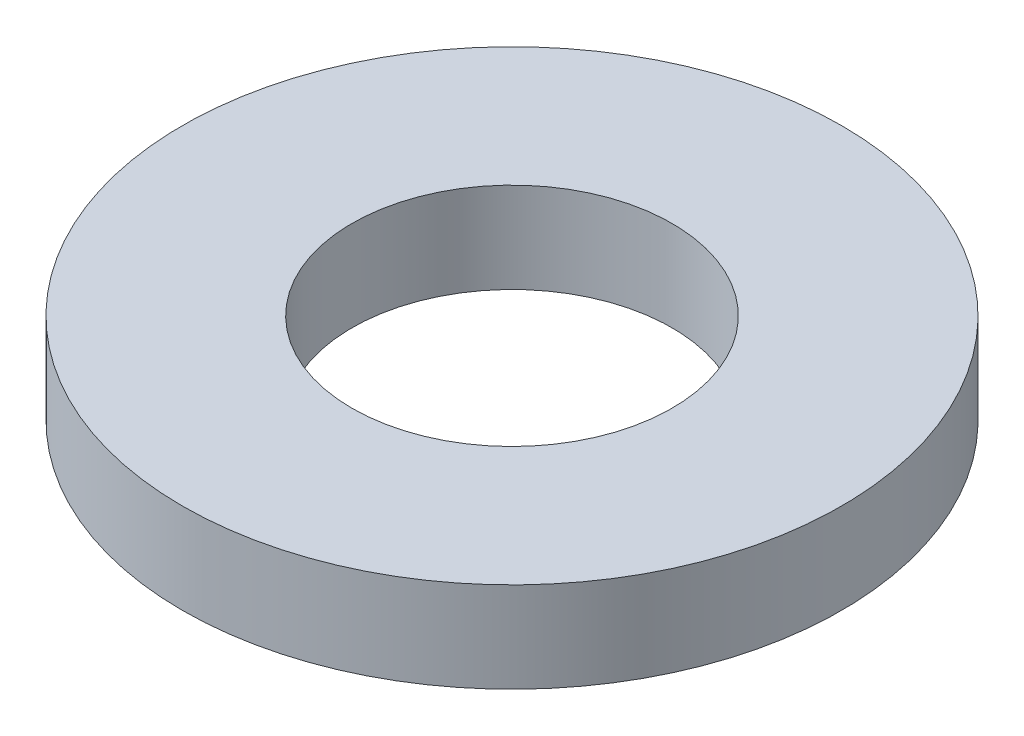
ISO-10303-21;
HEADER;
FILE_DESCRIPTION(('STEP AP214'),'2;1');
FILE_NAME('part.step','',(''),(''),'','','');
FILE_SCHEMA(('AUTOMOTIVE_DESIGN { 1 0 10303 214 1 1 1 1 }'));
ENDSEC;
DATA;
#1=APPLICATION_CONTEXT('core data for automotive mechanical design processes');
#2=APPLICATION_PROTOCOL_DEFINITION('international standard','automotive_design',2000,#1);
#3=PRODUCT_CONTEXT('',#1,'mechanical');
#4=PRODUCT('Part','Part','',(#3));
#5=PRODUCT_RELATED_PRODUCT_CATEGORY('part','',(#4));
#6=PRODUCT_DEFINITION_FORMATION('','',#4);
#7=PRODUCT_DEFINITION_CONTEXT('part definition',#1,'design');
#8=PRODUCT_DEFINITION('design','',#6,#7);
#9=PRODUCT_DEFINITION_SHAPE('','',#8);
#10=(LENGTH_UNIT() NAMED_UNIT(*) SI_UNIT(.MILLI.,.METRE.));
#11=(NAMED_UNIT(*) PLANE_ANGLE_UNIT() SI_UNIT($,.RADIAN.));
#12=(NAMED_UNIT(*) SI_UNIT($,.STERADIAN.) SOLID_ANGLE_UNIT());
#13=UNCERTAINTY_MEASURE_WITH_UNIT(LENGTH_MEASURE(1.E-05),#10,'distance_accuracy_value','');
#14=(GEOMETRIC_REPRESENTATION_CONTEXT(3) GLOBAL_UNCERTAINTY_ASSIGNED_CONTEXT((#13)) GLOBAL_UNIT_ASSIGNED_CONTEXT((#10,
#11,#12)) REPRESENTATION_CONTEXT('',''));
#15=CARTESIAN_POINT('',(0.,0.,0.));
#16=DIRECTION('',(0.,0.,1.));
#17=DIRECTION('',(1.,0.,0.));
#18=AXIS2_PLACEMENT_3D('',#15,#16,#17);
#19=CARTESIAN_POINT('',(0.,24.,0.));
#20=DIRECTION('',(0.,-1.,0.));
#21=DIRECTION('',(0.,0.,-1.));
#22=AXIS2_PLACEMENT_3D('',#19,#20,#21);
#23=CYLINDRICAL_SURFACE('',#22,87.5);
#24=CARTESIAN_POINT('',(0.,24.,0.));
#25=DIRECTION('',(0.,1.,0.));
#26=DIRECTION('',(0.,0.,1.));
#27=AXIS2_PLACEMENT_3D('',#24,#25,#26);
#28=CIRCLE('',#27,87.5);
#29=CARTESIAN_POINT('',(0.,24.,87.5));
#30=VERTEX_POINT('',#29);
#31=EDGE_CURVE('E10',#30,#30,#28,.T.);
#32=ORIENTED_EDGE('',*,*,#31,.F.);
#33=EDGE_LOOP('',(#32));
#34=FACE_BOUND('',#33,.T.);
#35=CARTESIAN_POINT('',(0.,0.,0.));
#36=DIRECTION('',(0.,1.,0.));
#37=DIRECTION('',(0.,0.,1.));
#38=AXIS2_PLACEMENT_3D('',#35,#36,#37);
#39=CIRCLE('',#38,87.5);
#40=CARTESIAN_POINT('',(0.,0.,87.5));
#41=VERTEX_POINT('',#40);
#42=EDGE_CURVE('E37',#41,#41,#39,.T.);
#43=ORIENTED_EDGE('',*,*,#42,.T.);
#44=EDGE_LOOP('',(#43));
#45=FACE_BOUND('',#44,.T.);
#46=ADVANCED_FACE('F40',(#34,#45),#23,.T.);
#47=CARTESIAN_POINT('',(0.,24.,0.));
#48=DIRECTION('',(0.,1.,0.));
#49=DIRECTION('',(0.,0.,1.));
#50=AXIS2_PLACEMENT_3D('',#47,#48,#49);
#51=PLANE('',#50);
#52=CARTESIAN_POINT('',(0.,24.,0.));
#53=DIRECTION('',(0.,1.,0.));
#54=DIRECTION('',(0.,0.,1.));
#55=AXIS2_PLACEMENT_3D('',#52,#53,#54);
#56=CIRCLE('',#55,42.5);
#57=CARTESIAN_POINT('',(0.,24.,42.5));
#58=VERTEX_POINT('',#57);
#59=EDGE_CURVE('E50',#58,#58,#56,.T.);
#60=ORIENTED_EDGE('',*,*,#59,.F.);
#61=EDGE_LOOP('',(#60));
#62=FACE_BOUND('',#61,.T.);
#63=ORIENTED_EDGE('',*,*,#31,.T.);
#64=EDGE_LOOP('',(#63));
#65=FACE_BOUND('',#64,.T.);
#66=ADVANCED_FACE('F59',(#62,#65),#51,.T.);
#67=CARTESIAN_POINT('',(0.,0.,0.));
#68=DIRECTION('',(0.,1.,0.));
#69=DIRECTION('',(0.,0.,1.));
#70=AXIS2_PLACEMENT_3D('',#67,#68,#69);
#71=PLANE('',#70);
#72=CARTESIAN_POINT('',(0.,0.,0.));
#73=DIRECTION('',(0.,1.,0.));
#74=DIRECTION('',(0.,0.,1.));
#75=AXIS2_PLACEMENT_3D('',#72,#73,#74);
#76=CIRCLE('',#75,42.5);
#77=CARTESIAN_POINT('',(0.,0.,42.5));
#78=VERTEX_POINT('',#77);
#79=EDGE_CURVE('E47',#78,#78,#76,.T.);
#80=ORIENTED_EDGE('',*,*,#79,.T.);
#81=EDGE_LOOP('',(#80));
#82=FACE_BOUND('',#81,.T.);
#83=ORIENTED_EDGE('',*,*,#42,.F.);
#84=EDGE_LOOP('',(#83));
#85=FACE_BOUND('',#84,.T.);
#86=ADVANCED_FACE('F58',(#82,#85),#71,.F.);
#87=CARTESIAN_POINT('',(0.,24.,0.));
#88=DIRECTION('',(0.,-1.,0.));
#89=DIRECTION('',(0.,0.,-1.));
#90=AXIS2_PLACEMENT_3D('',#87,#88,#89);
#91=CYLINDRICAL_SURFACE('',#90,42.5);
#92=ORIENTED_EDGE('',*,*,#59,.T.);
#93=EDGE_LOOP('',(#92));
#94=FACE_BOUND('',#93,.T.);
#95=ORIENTED_EDGE('',*,*,#79,.F.);
#96=EDGE_LOOP('',(#95));
#97=FACE_BOUND('',#96,.T.);
#98=ADVANCED_FACE('F54',(#94,#97),#91,.F.);
#99=CLOSED_SHELL('',(#46,#66,#86,#98));
#100=MANIFOLD_SOLID_BREP('B2',#99);
#101=ADVANCED_BREP_SHAPE_REPRESENTATION('',(#18,#100),#14);
#102=SHAPE_DEFINITION_REPRESENTATION(#9,#101);
ENDSEC;
END-ISO-10303-21;
